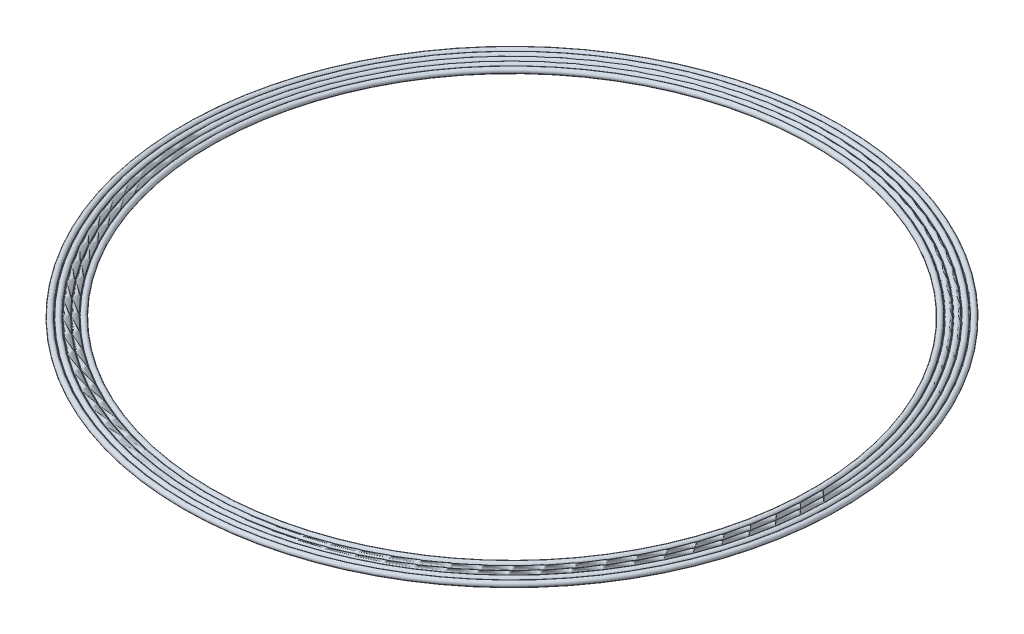
ISO-10303-21;
HEADER;
FILE_DESCRIPTION(('STEP AP214'),'2;1');
FILE_NAME('part.step','',(''),(''),'','','');
FILE_SCHEMA(('AUTOMOTIVE_DESIGN { 1 0 10303 214 1 1 1 1 }'));
ENDSEC;
DATA;
#1=APPLICATION_CONTEXT('core data for automotive mechanical design processes');
#2=APPLICATION_PROTOCOL_DEFINITION('international standard','automotive_design',2000,#1);
#3=PRODUCT_CONTEXT('',#1,'mechanical');
#4=PRODUCT('Part','Part','',(#3));
#5=PRODUCT_RELATED_PRODUCT_CATEGORY('part','',(#4));
#6=PRODUCT_DEFINITION_FORMATION('','',#4);
#7=PRODUCT_DEFINITION_CONTEXT('part definition',#1,'design');
#8=PRODUCT_DEFINITION('design','',#6,#7);
#9=PRODUCT_DEFINITION_SHAPE('','',#8);
#10=(LENGTH_UNIT() NAMED_UNIT(*) SI_UNIT(.MILLI.,.METRE.));
#11=(NAMED_UNIT(*) PLANE_ANGLE_UNIT() SI_UNIT($,.RADIAN.));
#12=(NAMED_UNIT(*) SI_UNIT($,.STERADIAN.) SOLID_ANGLE_UNIT());
#13=UNCERTAINTY_MEASURE_WITH_UNIT(LENGTH_MEASURE(1.E-05),#10,'distance_accuracy_value','');
#14=(GEOMETRIC_REPRESENTATION_CONTEXT(3) GLOBAL_UNCERTAINTY_ASSIGNED_CONTEXT((#13)) GLOBAL_UNIT_ASSIGNED_CONTEXT((#10,
#11,#12)) REPRESENTATION_CONTEXT('',''));
#15=CARTESIAN_POINT('',(0.,0.,0.));
#16=DIRECTION('',(0.,0.,1.));
#17=DIRECTION('',(1.,0.,0.));
#18=AXIS2_PLACEMENT_3D('',#15,#16,#17);
#19=CARTESIAN_POINT('',(0.,0.,0.));
#20=DIRECTION('',(0.,1.,0.));
#21=DIRECTION('',(0.,0.,1.));
#22=AXIS2_PLACEMENT_3D('',#19,#20,#21);
#23=TOROIDAL_SURFACE('',#22,99.05,0.850000000000006);
#24=CARTESIAN_POINT('',(0.,-0.2,0.));
#25=DIRECTION('',(0.,1.,0.));
#26=DIRECTION('',(0.,0.,1.));
#27=AXIS2_PLACEMENT_3D('',#24,#25,#26);
#28=CIRCLE('',#27,99.8761355820929);
#29=CARTESIAN_POINT('',(0.,-0.2,99.8761355820929));
#30=VERTEX_POINT('',#29);
#31=EDGE_CURVE('E10',#30,#30,#28,.T.);
#32=ORIENTED_EDGE('',*,*,#31,.F.);
#33=EDGE_LOOP('',(#32));
#34=FACE_BOUND('',#33,.T.);
#35=CARTESIAN_POINT('',(0.,-0.2,0.));
#36=DIRECTION('',(0.,1.,0.));
#37=DIRECTION('',(0.,0.,1.));
#38=AXIS2_PLACEMENT_3D('',#35,#36,#37);
#39=CIRCLE('',#38,98.2238644179071);
#40=CARTESIAN_POINT('',(0.,-0.2,98.2238644179071));
#41=VERTEX_POINT('',#40);
#42=EDGE_CURVE('E91',#41,#41,#39,.T.);
#43=ORIENTED_EDGE('',*,*,#42,.T.);
#44=EDGE_LOOP('',(#43));
#45=FACE_BOUND('',#44,.T.);
#46=ADVANCED_FACE('F39',(#34,#45),#23,.T.);
#47=CARTESIAN_POINT('',(99.8761355820929,-0.2,0.));
#48=DIRECTION('',(0.,1.,0.));
#49=DIRECTION('',(0.,0.,1.));
#50=AXIS2_PLACEMENT_3D('',#47,#48,#49);
#51=PLANE('',#50);
#52=CARTESIAN_POINT('',(0.,-0.2,0.));
#53=DIRECTION('',(0.,1.,0.));
#54=DIRECTION('',(0.,0.,1.));
#55=AXIS2_PLACEMENT_3D('',#52,#53,#54);
#56=CIRCLE('',#55,100.073864417907);
#57=CARTESIAN_POINT('',(0.,-0.2,100.073864417907));
#58=VERTEX_POINT('',#57);
#59=EDGE_CURVE('E45',#58,#58,#56,.T.);
#60=ORIENTED_EDGE('',*,*,#59,.F.);
#61=EDGE_LOOP('',(#60));
#62=FACE_BOUND('',#61,.T.);
#63=ORIENTED_EDGE('',*,*,#31,.T.);
#64=EDGE_LOOP('',(#63));
#65=FACE_BOUND('',#64,.T.);
#66=ADVANCED_FACE('F176',(#62,#65),#51,.F.);
#67=CARTESIAN_POINT('',(0.,0.,0.));
#68=DIRECTION('',(0.,1.,0.));
#69=DIRECTION('',(0.,0.,1.));
#70=AXIS2_PLACEMENT_3D('',#67,#68,#69);
#71=TOROIDAL_SURFACE('',#70,100.9,0.850000000000006);
#72=CARTESIAN_POINT('',(0.,0.2,0.));
#73=DIRECTION('',(0.,1.,0.));
#74=DIRECTION('',(0.,0.,1.));
#75=AXIS2_PLACEMENT_3D('',#72,#73,#74);
#76=CIRCLE('',#75,100.073864417907);
#77=CARTESIAN_POINT('',(0.,0.2,100.073864417907));
#78=VERTEX_POINT('',#77);
#79=EDGE_CURVE('E49',#78,#78,#76,.T.);
#80=ORIENTED_EDGE('',*,*,#79,.F.);
#81=EDGE_LOOP('',(#80));
#82=FACE_BOUND('',#81,.T.);
#83=ORIENTED_EDGE('',*,*,#59,.T.);
#84=EDGE_LOOP('',(#83));
#85=FACE_BOUND('',#84,.T.);
#86=ADVANCED_FACE('F171',(#82,#85),#71,.T.);
#87=CARTESIAN_POINT('',(99.8761355820929,0.2,0.));
#88=DIRECTION('',(0.,-1.,0.));
#89=DIRECTION('',(0.,0.,-1.));
#90=AXIS2_PLACEMENT_3D('',#87,#88,#89);
#91=PLANE('',#90);
#92=CARTESIAN_POINT('',(0.,0.2,0.));
#93=DIRECTION('',(0.,1.,0.));
#94=DIRECTION('',(0.,0.,1.));
#95=AXIS2_PLACEMENT_3D('',#92,#93,#94);
#96=CIRCLE('',#95,99.8761355820929);
#97=CARTESIAN_POINT('',(0.,0.2,99.8761355820929));
#98=VERTEX_POINT('',#97);
#99=EDGE_CURVE('E53',#98,#98,#96,.T.);
#100=ORIENTED_EDGE('',*,*,#99,.F.);
#101=EDGE_LOOP('',(#100));
#102=FACE_BOUND('',#101,.T.);
#103=ORIENTED_EDGE('',*,*,#79,.T.);
#104=EDGE_LOOP('',(#103));
#105=FACE_BOUND('',#104,.T.);
#106=ADVANCED_FACE('F165',(#102,#105),#91,.F.);
#107=CARTESIAN_POINT('',(0.,0.,0.));
#108=DIRECTION('',(0.,1.,0.));
#109=DIRECTION('',(0.,0.,1.));
#110=AXIS2_PLACEMENT_3D('',#107,#108,#109);
#111=TOROIDAL_SURFACE('',#110,99.05,0.850000000000006);
#112=CARTESIAN_POINT('',(0.,0.2,0.));
#113=DIRECTION('',(0.,1.,0.));
#114=DIRECTION('',(0.,0.,1.));
#115=AXIS2_PLACEMENT_3D('',#112,#113,#114);
#116=CIRCLE('',#115,98.2238644179071);
#117=CARTESIAN_POINT('',(0.,0.2,98.2238644179071));
#118=VERTEX_POINT('',#117);
#119=EDGE_CURVE('E58',#118,#118,#116,.T.);
#120=ORIENTED_EDGE('',*,*,#119,.F.);
#121=EDGE_LOOP('',(#120));
#122=FACE_BOUND('',#121,.T.);
#123=ORIENTED_EDGE('',*,*,#99,.T.);
#124=EDGE_LOOP('',(#123));
#125=FACE_BOUND('',#124,.T.);
#126=ADVANCED_FACE('F159',(#122,#125),#111,.T.);
#127=CARTESIAN_POINT('',(98.0261355820929,0.2,0.));
#128=DIRECTION('',(0.,-1.,0.));
#129=DIRECTION('',(0.,0.,-1.));
#130=AXIS2_PLACEMENT_3D('',#127,#128,#129);
#131=PLANE('',#130);
#132=CARTESIAN_POINT('',(0.,0.2,0.));
#133=DIRECTION('',(0.,1.,0.));
#134=DIRECTION('',(0.,0.,1.));
#135=AXIS2_PLACEMENT_3D('',#132,#133,#134);
#136=CIRCLE('',#135,98.0261355820929);
#137=CARTESIAN_POINT('',(0.,0.2,98.0261355820929));
#138=VERTEX_POINT('',#137);
#139=EDGE_CURVE('E61',#138,#138,#136,.T.);
#140=ORIENTED_EDGE('',*,*,#139,.F.);
#141=EDGE_LOOP('',(#140));
#142=FACE_BOUND('',#141,.T.);
#143=ORIENTED_EDGE('',*,*,#119,.T.);
#144=EDGE_LOOP('',(#143));
#145=FACE_BOUND('',#144,.T.);
#146=ADVANCED_FACE('F153',(#142,#145),#131,.F.);
#147=CARTESIAN_POINT('',(0.,0.,0.));
#148=DIRECTION('',(0.,1.,0.));
#149=DIRECTION('',(0.,0.,1.));
#150=AXIS2_PLACEMENT_3D('',#147,#148,#149);
#151=TOROIDAL_SURFACE('',#150,97.2,0.850000000000006);
#152=CARTESIAN_POINT('',(0.,0.2,0.));
#153=DIRECTION('',(0.,1.,0.));
#154=DIRECTION('',(0.,0.,1.));
#155=AXIS2_PLACEMENT_3D('',#152,#153,#154);
#156=CIRCLE('',#155,96.3738644179071);
#157=CARTESIAN_POINT('',(0.,0.2,96.3738644179071));
#158=VERTEX_POINT('',#157);
#159=EDGE_CURVE('E64',#158,#158,#156,.T.);
#160=ORIENTED_EDGE('',*,*,#159,.F.);
#161=EDGE_LOOP('',(#160));
#162=FACE_BOUND('',#161,.T.);
#163=ORIENTED_EDGE('',*,*,#139,.T.);
#164=EDGE_LOOP('',(#163));
#165=FACE_BOUND('',#164,.T.);
#166=ADVANCED_FACE('F147',(#162,#165),#151,.T.);
#167=CARTESIAN_POINT('',(96.1761355820929,0.2,0.));
#168=DIRECTION('',(0.,-1.,0.));
#169=DIRECTION('',(0.,0.,-1.));
#170=AXIS2_PLACEMENT_3D('',#167,#168,#169);
#171=PLANE('',#170);
#172=CARTESIAN_POINT('',(0.,0.2,0.));
#173=DIRECTION('',(0.,1.,0.));
#174=DIRECTION('',(0.,0.,1.));
#175=AXIS2_PLACEMENT_3D('',#172,#173,#174);
#176=CIRCLE('',#175,96.1761355820929);
#177=CARTESIAN_POINT('',(0.,0.2,96.1761355820929));
#178=VERTEX_POINT('',#177);
#179=EDGE_CURVE('E67',#178,#178,#176,.T.);
#180=ORIENTED_EDGE('',*,*,#179,.F.);
#181=EDGE_LOOP('',(#180));
#182=FACE_BOUND('',#181,.T.);
#183=ORIENTED_EDGE('',*,*,#159,.T.);
#184=EDGE_LOOP('',(#183));
#185=FACE_BOUND('',#184,.T.);
#186=ADVANCED_FACE('F141',(#182,#185),#171,.F.);
#187=CARTESIAN_POINT('',(0.,0.,0.));
#188=DIRECTION('',(0.,1.,0.));
#189=DIRECTION('',(0.,0.,1.));
#190=AXIS2_PLACEMENT_3D('',#187,#188,#189);
#191=TOROIDAL_SURFACE('',#190,95.35,0.850000000000006);
#192=CARTESIAN_POINT('',(0.,0.2,0.));
#193=DIRECTION('',(0.,1.,0.));
#194=DIRECTION('',(0.,0.,1.));
#195=AXIS2_PLACEMENT_3D('',#192,#193,#194);
#196=CIRCLE('',#195,94.523864417907);
#197=CARTESIAN_POINT('',(0.,0.2,94.523864417907));
#198=VERTEX_POINT('',#197);
#199=EDGE_CURVE('E70',#198,#198,#196,.T.);
#200=ORIENTED_EDGE('',*,*,#199,.F.);
#201=EDGE_LOOP('',(#200));
#202=FACE_BOUND('',#201,.T.);
#203=ORIENTED_EDGE('',*,*,#179,.T.);
#204=EDGE_LOOP('',(#203));
#205=FACE_BOUND('',#204,.T.);
#206=ADVANCED_FACE('F135',(#202,#205),#191,.T.);
#207=CARTESIAN_POINT('',(94.3261355820929,0.2,0.));
#208=DIRECTION('',(0.,-1.,0.));
#209=DIRECTION('',(0.,0.,-1.));
#210=AXIS2_PLACEMENT_3D('',#207,#208,#209);
#211=PLANE('',#210);
#212=CARTESIAN_POINT('',(0.,0.2,0.));
#213=DIRECTION('',(0.,1.,0.));
#214=DIRECTION('',(0.,0.,1.));
#215=AXIS2_PLACEMENT_3D('',#212,#213,#214);
#216=CIRCLE('',#215,94.3261355820929);
#217=CARTESIAN_POINT('',(0.,0.2,94.3261355820929));
#218=VERTEX_POINT('',#217);
#219=EDGE_CURVE('E73',#218,#218,#216,.T.);
#220=ORIENTED_EDGE('',*,*,#219,.F.);
#221=EDGE_LOOP('',(#220));
#222=FACE_BOUND('',#221,.T.);
#223=ORIENTED_EDGE('',*,*,#199,.T.);
#224=EDGE_LOOP('',(#223));
#225=FACE_BOUND('',#224,.T.);
#226=ADVANCED_FACE('F129',(#222,#225),#211,.F.);
#227=CARTESIAN_POINT('',(0.,0.,0.));
#228=DIRECTION('',(0.,1.,0.));
#229=DIRECTION('',(0.,0.,1.));
#230=AXIS2_PLACEMENT_3D('',#227,#228,#229);
#231=TOROIDAL_SURFACE('',#230,93.5,0.850000000000006);
#232=CARTESIAN_POINT('',(0.,-0.2,0.));
#233=DIRECTION('',(0.,1.,0.));
#234=DIRECTION('',(0.,0.,1.));
#235=AXIS2_PLACEMENT_3D('',#232,#233,#234);
#236=CIRCLE('',#235,94.3261355820929);
#237=CARTESIAN_POINT('',(0.,-0.2,94.3261355820929));
#238=VERTEX_POINT('',#237);
#239=EDGE_CURVE('E76',#238,#238,#236,.T.);
#240=ORIENTED_EDGE('',*,*,#239,.F.);
#241=EDGE_LOOP('',(#240));
#242=FACE_BOUND('',#241,.T.);
#243=ORIENTED_EDGE('',*,*,#219,.T.);
#244=EDGE_LOOP('',(#243));
#245=FACE_BOUND('',#244,.T.);
#246=ADVANCED_FACE('F123',(#242,#245),#231,.T.);
#247=CARTESIAN_POINT('',(94.3261355820929,-0.2,0.));
#248=DIRECTION('',(0.,1.,0.));
#249=DIRECTION('',(0.,0.,1.));
#250=AXIS2_PLACEMENT_3D('',#247,#248,#249);
#251=PLANE('',#250);
#252=CARTESIAN_POINT('',(0.,-0.2,0.));
#253=DIRECTION('',(0.,1.,0.));
#254=DIRECTION('',(0.,0.,1.));
#255=AXIS2_PLACEMENT_3D('',#252,#253,#254);
#256=CIRCLE('',#255,94.523864417907);
#257=CARTESIAN_POINT('',(0.,-0.2,94.523864417907));
#258=VERTEX_POINT('',#257);
#259=EDGE_CURVE('E79',#258,#258,#256,.T.);
#260=ORIENTED_EDGE('',*,*,#259,.F.);
#261=EDGE_LOOP('',(#260));
#262=FACE_BOUND('',#261,.T.);
#263=ORIENTED_EDGE('',*,*,#239,.T.);
#264=EDGE_LOOP('',(#263));
#265=FACE_BOUND('',#264,.T.);
#266=ADVANCED_FACE('F117',(#262,#265),#251,.F.);
#267=CARTESIAN_POINT('',(0.,0.,0.));
#268=DIRECTION('',(0.,1.,0.));
#269=DIRECTION('',(0.,0.,1.));
#270=AXIS2_PLACEMENT_3D('',#267,#268,#269);
#271=TOROIDAL_SURFACE('',#270,95.35,0.850000000000006);
#272=CARTESIAN_POINT('',(0.,-0.2,0.));
#273=DIRECTION('',(0.,1.,0.));
#274=DIRECTION('',(0.,0.,1.));
#275=AXIS2_PLACEMENT_3D('',#272,#273,#274);
#276=CIRCLE('',#275,96.1761355820929);
#277=CARTESIAN_POINT('',(0.,-0.2,96.1761355820929));
#278=VERTEX_POINT('',#277);
#279=EDGE_CURVE('E82',#278,#278,#276,.T.);
#280=ORIENTED_EDGE('',*,*,#279,.F.);
#281=EDGE_LOOP('',(#280));
#282=FACE_BOUND('',#281,.T.);
#283=ORIENTED_EDGE('',*,*,#259,.T.);
#284=EDGE_LOOP('',(#283));
#285=FACE_BOUND('',#284,.T.);
#286=ADVANCED_FACE('F111',(#282,#285),#271,.T.);
#287=CARTESIAN_POINT('',(96.1761355820929,-0.2,0.));
#288=DIRECTION('',(0.,1.,0.));
#289=DIRECTION('',(0.,0.,1.));
#290=AXIS2_PLACEMENT_3D('',#287,#288,#289);
#291=PLANE('',#290);
#292=CARTESIAN_POINT('',(0.,-0.2,0.));
#293=DIRECTION('',(0.,1.,0.));
#294=DIRECTION('',(0.,0.,1.));
#295=AXIS2_PLACEMENT_3D('',#292,#293,#294);
#296=CIRCLE('',#295,96.3738644179071);
#297=CARTESIAN_POINT('',(0.,-0.2,96.3738644179071));
#298=VERTEX_POINT('',#297);
#299=EDGE_CURVE('E85',#298,#298,#296,.T.);
#300=ORIENTED_EDGE('',*,*,#299,.F.);
#301=EDGE_LOOP('',(#300));
#302=FACE_BOUND('',#301,.T.);
#303=ORIENTED_EDGE('',*,*,#279,.T.);
#304=EDGE_LOOP('',(#303));
#305=FACE_BOUND('',#304,.T.);
#306=ADVANCED_FACE('F105',(#302,#305),#291,.F.);
#307=CARTESIAN_POINT('',(0.,0.,0.));
#308=DIRECTION('',(0.,1.,0.));
#309=DIRECTION('',(0.,0.,1.));
#310=AXIS2_PLACEMENT_3D('',#307,#308,#309);
#311=TOROIDAL_SURFACE('',#310,97.2,0.850000000000006);
#312=CARTESIAN_POINT('',(0.,-0.2,0.));
#313=DIRECTION('',(0.,1.,0.));
#314=DIRECTION('',(0.,0.,1.));
#315=AXIS2_PLACEMENT_3D('',#312,#313,#314);
#316=CIRCLE('',#315,98.0261355820929);
#317=CARTESIAN_POINT('',(0.,-0.2,98.0261355820929));
#318=VERTEX_POINT('',#317);
#319=EDGE_CURVE('E88',#318,#318,#316,.T.);
#320=ORIENTED_EDGE('',*,*,#319,.F.);
#321=EDGE_LOOP('',(#320));
#322=FACE_BOUND('',#321,.T.);
#323=ORIENTED_EDGE('',*,*,#299,.T.);
#324=EDGE_LOOP('',(#323));
#325=FACE_BOUND('',#324,.T.);
#326=ADVANCED_FACE('F99',(#322,#325),#311,.T.);
#327=CARTESIAN_POINT('',(98.0261355820929,-0.2,0.));
#328=DIRECTION('',(0.,1.,0.));
#329=DIRECTION('',(0.,0.,1.));
#330=AXIS2_PLACEMENT_3D('',#327,#328,#329);
#331=PLANE('',#330);
#332=ORIENTED_EDGE('',*,*,#42,.F.);
#333=EDGE_LOOP('',(#332));
#334=FACE_BOUND('',#333,.T.);
#335=ORIENTED_EDGE('',*,*,#319,.T.);
#336=EDGE_LOOP('',(#335));
#337=FACE_BOUND('',#336,.T.);
#338=ADVANCED_FACE('F96',(#334,#337),#331,.F.);
#339=CLOSED_SHELL('',(#46,#66,#86,#106,#126,#146,#166,#186,#206,#226,#246,#266,#286,#306,#326,#338));
#340=MANIFOLD_SOLID_BREP('B2',#339);
#341=ADVANCED_BREP_SHAPE_REPRESENTATION('',(#18,#340),#14);
#342=SHAPE_DEFINITION_REPRESENTATION(#9,#341);
ENDSEC;
END-ISO-10303-21;
